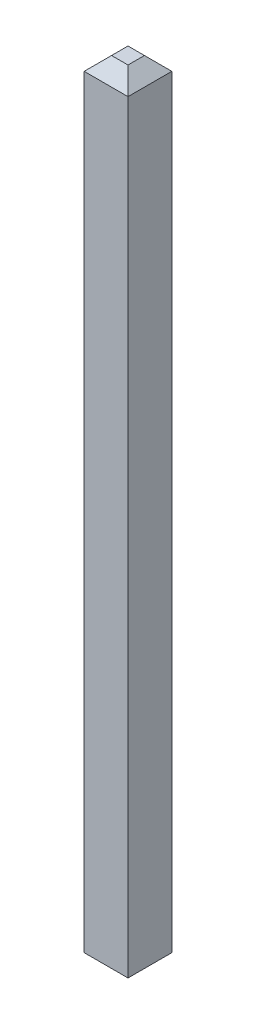
ISO-10303-21;
HEADER;
FILE_DESCRIPTION(('STEP AP214'),'2;1');
FILE_NAME('part.step','',(''),(''),'','','');
FILE_SCHEMA(('AUTOMOTIVE_DESIGN { 1 0 10303 214 1 1 1 1 }'));
ENDSEC;
DATA;
#1=APPLICATION_CONTEXT('core data for automotive mechanical design processes');
#2=APPLICATION_PROTOCOL_DEFINITION('international standard','automotive_design',2000,#1);
#3=PRODUCT_CONTEXT('',#1,'mechanical');
#4=PRODUCT('Part','Part','',(#3));
#5=PRODUCT_RELATED_PRODUCT_CATEGORY('part','',(#4));
#6=PRODUCT_DEFINITION_FORMATION('','',#4);
#7=PRODUCT_DEFINITION_CONTEXT('part definition',#1,'design');
#8=PRODUCT_DEFINITION('design','',#6,#7);
#9=PRODUCT_DEFINITION_SHAPE('','',#8);
#10=(LENGTH_UNIT() NAMED_UNIT(*) SI_UNIT(.MILLI.,.METRE.));
#11=(NAMED_UNIT(*) PLANE_ANGLE_UNIT() SI_UNIT($,.RADIAN.));
#12=(NAMED_UNIT(*) SI_UNIT($,.STERADIAN.) SOLID_ANGLE_UNIT());
#13=UNCERTAINTY_MEASURE_WITH_UNIT(LENGTH_MEASURE(1.E-05),#10,'distance_accuracy_value','');
#14=(GEOMETRIC_REPRESENTATION_CONTEXT(3) GLOBAL_UNCERTAINTY_ASSIGNED_CONTEXT((#13)) GLOBAL_UNIT_ASSIGNED_CONTEXT((#10,
#11,#12)) REPRESENTATION_CONTEXT('',''));
#15=CARTESIAN_POINT('',(0.,0.,0.));
#16=DIRECTION('',(0.,0.,1.));
#17=DIRECTION('',(1.,0.,0.));
#18=AXIS2_PLACEMENT_3D('',#15,#16,#17);
#19=CARTESIAN_POINT('',(-0.95,7.07,-0.32));
#20=DIRECTION('',(-0.707106781186548,-0.707106781186548,0.));
#21=DIRECTION('',(-0.707106781186548,0.707106781186548,0.));
#22=AXIS2_PLACEMENT_3D('',#19,#20,#21);
#23=PLANE('',#22);
#24=DIRECTION('',(0.577350269189626,-0.577350269189626,0.577350269189626));
#25=VECTOR('',#24,1.);
#26=CARTESIAN_POINT('',(-1.163333333333,7.283333333333,0.106666666667));
#27=LINE('',#26,#25);
#28=CARTESIAN_POINT('',(-1.15,7.27,0.12));
#29=VERTEX_POINT('',#28);
#30=CARTESIAN_POINT('',(-0.95,7.07,0.32));
#31=VERTEX_POINT('',#30);
#32=EDGE_CURVE('E70',#29,#31,#27,.T.);
#33=ORIENTED_EDGE('',*,*,#32,.T.);
#34=DIRECTION('',(0.,0.,1.));
#35=VECTOR('',#34,1.);
#36=CARTESIAN_POINT('',(-0.95,7.07,-0.32));
#37=LINE('',#36,#35);
#38=CARTESIAN_POINT('',(-0.95,7.07,-0.32));
#39=VERTEX_POINT('',#38);
#40=EDGE_CURVE('E171',#39,#31,#37,.T.);
#41=ORIENTED_EDGE('',*,*,#40,.F.);
#42=DIRECTION('',(0.577350269189626,-0.577350269189626,-0.577350269189626));
#43=VECTOR('',#42,1.);
#44=CARTESIAN_POINT('',(-0.95,7.07,-0.32));
#45=LINE('',#44,#43);
#46=CARTESIAN_POINT('',(-1.15,7.27,-0.12));
#47=VERTEX_POINT('',#46);
#48=EDGE_CURVE('E11',#47,#39,#45,.T.);
#49=ORIENTED_EDGE('',*,*,#48,.F.);
#50=DIRECTION('',(0.,0.,-1.));
#51=VECTOR('',#50,1.);
#52=CARTESIAN_POINT('',(-1.15,7.27,-0.32));
#53=LINE('',#52,#51);
#54=EDGE_CURVE('E174',#29,#47,#53,.T.);
#55=ORIENTED_EDGE('',*,*,#54,.F.);
#56=EDGE_LOOP('',(#33,#41,#49,#55));
#57=FACE_BOUND('',#56,.T.);
#58=ADVANCED_FACE('F17',(#57),#23,.F.);
#59=CARTESIAN_POINT('',(-1.27,7.07,-0.32));
#60=DIRECTION('',(0.,0.707106781186548,-0.707106781186548));
#61=DIRECTION('',(-1.,0.,0.));
#62=AXIS2_PLACEMENT_3D('',#59,#60,#61);
#63=PLANE('',#62);
#64=DIRECTION('',(0.577350269189626,0.577350269189626,0.577350269189626));
#65=VECTOR('',#64,1.);
#66=CARTESIAN_POINT('',(-1.456666666667,7.203333333333,-0.186666666667));
#67=LINE('',#66,#65);
#68=CARTESIAN_POINT('',(-1.59,7.07,-0.32));
#69=VERTEX_POINT('',#68);
#70=CARTESIAN_POINT('',(-1.39,7.27,-0.12));
#71=VERTEX_POINT('',#70);
#72=EDGE_CURVE('E21',#69,#71,#67,.T.);
#73=ORIENTED_EDGE('',*,*,#72,.T.);
#74=DIRECTION('',(-1.,0.,0.));
#75=VECTOR('',#74,1.);
#76=CARTESIAN_POINT('',(-1.59,7.27,-0.12));
#77=LINE('',#76,#75);
#78=EDGE_CURVE('E178',#47,#71,#77,.T.);
#79=ORIENTED_EDGE('',*,*,#78,.F.);
#80=ORIENTED_EDGE('',*,*,#48,.T.);
#81=DIRECTION('',(1.,0.,0.));
#82=VECTOR('',#81,1.);
#83=CARTESIAN_POINT('',(-0.95,7.07,-0.32));
#84=LINE('',#83,#82);
#85=EDGE_CURVE('E161',#69,#39,#84,.T.);
#86=ORIENTED_EDGE('',*,*,#85,.F.);
#87=EDGE_LOOP('',(#73,#79,#80,#86));
#88=FACE_BOUND('',#87,.T.);
#89=ADVANCED_FACE('F19',(#88),#63,.T.);
#90=CARTESIAN_POINT('',(-1.39,7.27,-0.32));
#91=DIRECTION('',(0.707106781186548,-0.707106781186548,0.));
#92=DIRECTION('',(0.,0.,-1.));
#93=AXIS2_PLACEMENT_3D('',#90,#91,#92);
#94=PLANE('',#93);
#95=DIRECTION('',(-0.577350269189626,-0.577350269189626,0.577350269189626));
#96=VECTOR('',#95,1.);
#97=CARTESIAN_POINT('',(-1.456666666667,7.203333333333,0.186666666667));
#98=LINE('',#97,#96);
#99=CARTESIAN_POINT('',(-1.39,7.27,0.12));
#100=VERTEX_POINT('',#99);
#101=CARTESIAN_POINT('',(-1.59,7.07,0.32));
#102=VERTEX_POINT('',#101);
#103=EDGE_CURVE('E41',#100,#102,#98,.T.);
#104=ORIENTED_EDGE('',*,*,#103,.F.);
#105=DIRECTION('',(0.,0.,1.));
#106=VECTOR('',#105,1.);
#107=CARTESIAN_POINT('',(-1.39,7.27,-0.32));
#108=LINE('',#107,#106);
#109=EDGE_CURVE('E182',#71,#100,#108,.T.);
#110=ORIENTED_EDGE('',*,*,#109,.F.);
#111=ORIENTED_EDGE('',*,*,#72,.F.);
#112=DIRECTION('',(0.,0.,-1.));
#113=VECTOR('',#112,1.);
#114=CARTESIAN_POINT('',(-1.59,7.07,-0.32));
#115=LINE('',#114,#113);
#116=EDGE_CURVE('E148',#102,#69,#115,.T.);
#117=ORIENTED_EDGE('',*,*,#116,.F.);
#118=EDGE_LOOP('',(#104,#110,#111,#117));
#119=FACE_BOUND('',#118,.T.);
#120=ADVANCED_FACE('F249',(#119),#94,.F.);
#121=CARTESIAN_POINT('',(-1.59,7.27,0.12));
#122=DIRECTION('',(0.,-0.707106781186548,-0.707106781186548));
#123=DIRECTION('',(0.,-0.707106781186548,0.707106781186548));
#124=AXIS2_PLACEMENT_3D('',#121,#122,#123);
#125=PLANE('',#124);
#126=ORIENTED_EDGE('',*,*,#32,.F.);
#127=DIRECTION('',(1.,0.,0.));
#128=VECTOR('',#127,1.);
#129=CARTESIAN_POINT('',(-1.59,7.27,0.12));
#130=LINE('',#129,#128);
#131=EDGE_CURVE('E185',#100,#29,#130,.T.);
#132=ORIENTED_EDGE('',*,*,#131,.F.);
#133=ORIENTED_EDGE('',*,*,#103,.T.);
#134=DIRECTION('',(-1.,0.,0.));
#135=VECTOR('',#134,1.);
#136=CARTESIAN_POINT('',(-1.27,7.07,0.32));
#137=LINE('',#136,#135);
#138=EDGE_CURVE('E153',#31,#102,#137,.T.);
#139=ORIENTED_EDGE('',*,*,#138,.F.);
#140=EDGE_LOOP('',(#126,#132,#133,#139));
#141=FACE_BOUND('',#140,.T.);
#142=ADVANCED_FACE('F240',(#141),#125,.F.);
#143=CARTESIAN_POINT('',(-1.59,7.27,-0.32));
#144=DIRECTION('',(0.,-1.,0.));
#145=DIRECTION('',(0.,0.,-1.));
#146=AXIS2_PLACEMENT_3D('',#143,#144,#145);
#147=PLANE('',#146);
#148=ORIENTED_EDGE('',*,*,#54,.T.);
#149=ORIENTED_EDGE('',*,*,#78,.T.);
#150=ORIENTED_EDGE('',*,*,#109,.T.);
#151=ORIENTED_EDGE('',*,*,#131,.T.);
#152=EDGE_LOOP('',(#148,#149,#150,#151));
#153=FACE_BOUND('',#152,.T.);
#154=ADVANCED_FACE('F231',(#153),#147,.F.);
#155=CARTESIAN_POINT('',(-0.95,7.27,-0.32));
#156=DIRECTION('',(-1.,0.,0.));
#157=DIRECTION('',(0.,1.,0.));
#158=AXIS2_PLACEMENT_3D('',#155,#156,#157);
#159=PLANE('',#158);
#160=DIRECTION('',(0.,-1.,0.));
#161=VECTOR('',#160,1.);
#162=CARTESIAN_POINT('',(-0.95,7.27,-0.32));
#163=LINE('',#162,#161);
#164=CARTESIAN_POINT('',(-0.95,-4.07,-0.32));
#165=VERTEX_POINT('',#164);
#166=EDGE_CURVE('E155',#39,#165,#163,.T.);
#167=ORIENTED_EDGE('',*,*,#166,.F.);
#168=ORIENTED_EDGE('',*,*,#40,.T.);
#169=DIRECTION('',(0.,-1.,0.));
#170=VECTOR('',#169,1.);
#171=CARTESIAN_POINT('',(-0.95,7.27,0.32));
#172=LINE('',#171,#170);
#173=CARTESIAN_POINT('',(-0.95,-4.07,0.32));
#174=VERTEX_POINT('',#173);
#175=EDGE_CURVE('E82',#31,#174,#172,.T.);
#176=ORIENTED_EDGE('',*,*,#175,.T.);
#177=DIRECTION('',(0.,0.,-1.));
#178=VECTOR('',#177,1.);
#179=CARTESIAN_POINT('',(-0.95,-4.07,-0.32));
#180=LINE('',#179,#178);
#181=EDGE_CURVE('E115',#174,#165,#180,.T.);
#182=ORIENTED_EDGE('',*,*,#181,.T.);
#183=EDGE_LOOP('',(#167,#168,#176,#182));
#184=FACE_BOUND('',#183,.T.);
#185=ADVANCED_FACE('F229',(#184),#159,.F.);
#186=CARTESIAN_POINT('',(-1.27,1.5,0.32));
#187=DIRECTION('',(0.,0.,-1.));
#188=DIRECTION('',(0.,-1.,0.));
#189=AXIS2_PLACEMENT_3D('',#186,#187,#188);
#190=PLANE('',#189);
#191=ORIENTED_EDGE('',*,*,#175,.F.);
#192=ORIENTED_EDGE('',*,*,#138,.T.);
#193=DIRECTION('',(0.,1.,0.));
#194=VECTOR('',#193,1.);
#195=CARTESIAN_POINT('',(-1.59,-4.27,0.32));
#196=LINE('',#195,#194);
#197=CARTESIAN_POINT('',(-1.59,-4.07,0.32));
#198=VERTEX_POINT('',#197);
#199=EDGE_CURVE('E143',#198,#102,#196,.T.);
#200=ORIENTED_EDGE('',*,*,#199,.F.);
#201=DIRECTION('',(1.,0.,0.));
#202=VECTOR('',#201,1.);
#203=CARTESIAN_POINT('',(-1.27,-4.07,0.32));
#204=LINE('',#203,#202);
#205=EDGE_CURVE('E124',#198,#174,#204,.T.);
#206=ORIENTED_EDGE('',*,*,#205,.T.);
#207=EDGE_LOOP('',(#191,#192,#200,#206));
#208=FACE_BOUND('',#207,.T.);
#209=ADVANCED_FACE('F151',(#208),#190,.F.);
#210=CARTESIAN_POINT('',(-1.15,-4.27,-0.32));
#211=DIRECTION('',(-0.707106781186548,0.707106781186548,0.));
#212=DIRECTION('',(0.,0.,1.));
#213=AXIS2_PLACEMENT_3D('',#210,#211,#212);
#214=PLANE('',#213);
#215=DIRECTION('',(-0.577350269189626,-0.577350269189626,0.577350269189626));
#216=VECTOR('',#215,1.);
#217=CARTESIAN_POINT('',(-1.083333333333,-4.203333333333,-0.186666666667));
#218=LINE('',#217,#216);
#219=CARTESIAN_POINT('',(-1.15,-4.27,-0.12));
#220=VERTEX_POINT('',#219);
#221=EDGE_CURVE('E210',#165,#220,#218,.T.);
#222=ORIENTED_EDGE('',*,*,#221,.F.);
#223=ORIENTED_EDGE('',*,*,#181,.F.);
#224=DIRECTION('',(-0.577350269189626,-0.577350269189626,-0.577350269189626));
#225=VECTOR('',#224,1.);
#226=CARTESIAN_POINT('',(-1.296666666667,-4.416666666667,-0.02666666666667));
#227=LINE('',#226,#225);
#228=CARTESIAN_POINT('',(-1.15,-4.27,0.12));
#229=VERTEX_POINT('',#228);
#230=EDGE_CURVE('E128',#174,#229,#227,.T.);
#231=ORIENTED_EDGE('',*,*,#230,.T.);
#232=DIRECTION('',(0.,0.,1.));
#233=VECTOR('',#232,1.);
#234=CARTESIAN_POINT('',(-1.15,-4.27,-0.32));
#235=LINE('',#234,#233);
#236=EDGE_CURVE('E263',#220,#229,#235,.T.);
#237=ORIENTED_EDGE('',*,*,#236,.F.);
#238=EDGE_LOOP('',(#222,#223,#231,#237));
#239=FACE_BOUND('',#238,.T.);
#240=ADVANCED_FACE('F238',(#239),#214,.F.);
#241=CARTESIAN_POINT('',(-0.95,-4.27,0.12));
#242=DIRECTION('',(0.,0.707106781186548,-0.707106781186548));
#243=DIRECTION('',(-1.,0.,0.));
#244=AXIS2_PLACEMENT_3D('',#241,#242,#243);
#245=PLANE('',#244);
#246=ORIENTED_EDGE('',*,*,#230,.F.);
#247=ORIENTED_EDGE('',*,*,#205,.F.);
#248=DIRECTION('',(-0.577350269189626,0.577350269189626,0.577350269189626));
#249=VECTOR('',#248,1.);
#250=CARTESIAN_POINT('',(-1.376666666667,-4.283333333333,0.106666666667));
#251=LINE('',#250,#249);
#252=CARTESIAN_POINT('',(-1.39,-4.27,0.12));
#253=VERTEX_POINT('',#252);
#254=EDGE_CURVE('E127',#253,#198,#251,.T.);
#255=ORIENTED_EDGE('',*,*,#254,.F.);
#256=DIRECTION('',(-1.,0.,0.));
#257=VECTOR('',#256,1.);
#258=CARTESIAN_POINT('',(-0.95,-4.27,0.12));
#259=LINE('',#258,#257);
#260=EDGE_CURVE('E200',#229,#253,#259,.T.);
#261=ORIENTED_EDGE('',*,*,#260,.F.);
#262=EDGE_LOOP('',(#246,#247,#255,#261));
#263=FACE_BOUND('',#262,.T.);
#264=ADVANCED_FACE('F125',(#263),#245,.F.);
#265=CARTESIAN_POINT('',(-1.59,-4.07,-0.32));
#266=DIRECTION('',(0.707106781186548,0.707106781186548,0.));
#267=DIRECTION('',(0.,0.,-1.));
#268=AXIS2_PLACEMENT_3D('',#265,#266,#267);
#269=PLANE('',#268);
#270=DIRECTION('',(0.577350269189626,-0.577350269189626,0.577350269189626));
#271=VECTOR('',#270,1.);
#272=CARTESIAN_POINT('',(-1.483333333333,-4.176666666667,-0.213333333333));
#273=LINE('',#272,#271);
#274=CARTESIAN_POINT('',(-1.59,-4.07,-0.32));
#275=VERTEX_POINT('',#274);
#276=CARTESIAN_POINT('',(-1.39,-4.27,-0.12));
#277=VERTEX_POINT('',#276);
#278=EDGE_CURVE('E104',#275,#277,#273,.T.);
#279=ORIENTED_EDGE('',*,*,#278,.T.);
#280=DIRECTION('',(0.,0.,-1.));
#281=VECTOR('',#280,1.);
#282=CARTESIAN_POINT('',(-1.39,-4.27,-0.32));
#283=LINE('',#282,#281);
#284=EDGE_CURVE('E135',#253,#277,#283,.T.);
#285=ORIENTED_EDGE('',*,*,#284,.F.);
#286=ORIENTED_EDGE('',*,*,#254,.T.);
#287=DIRECTION('',(0.,0.,1.));
#288=VECTOR('',#287,1.);
#289=CARTESIAN_POINT('',(-1.59,-4.07,-0.32));
#290=LINE('',#289,#288);
#291=EDGE_CURVE('E109',#275,#198,#290,.T.);
#292=ORIENTED_EDGE('',*,*,#291,.F.);
#293=EDGE_LOOP('',(#279,#285,#286,#292));
#294=FACE_BOUND('',#293,.T.);
#295=ADVANCED_FACE('F133',(#294),#269,.F.);
#296=CARTESIAN_POINT('',(-1.59,-4.27,-0.32));
#297=DIRECTION('',(1.,0.,0.));
#298=DIRECTION('',(0.,0.,1.));
#299=AXIS2_PLACEMENT_3D('',#296,#297,#298);
#300=PLANE('',#299);
#301=ORIENTED_EDGE('',*,*,#199,.T.);
#302=ORIENTED_EDGE('',*,*,#116,.T.);
#303=DIRECTION('',(0.,1.,0.));
#304=VECTOR('',#303,1.);
#305=CARTESIAN_POINT('',(-1.59,-4.27,-0.32));
#306=LINE('',#305,#304);
#307=EDGE_CURVE('E145',#275,#69,#306,.T.);
#308=ORIENTED_EDGE('',*,*,#307,.F.);
#309=ORIENTED_EDGE('',*,*,#291,.T.);
#310=EDGE_LOOP('',(#301,#302,#308,#309));
#311=FACE_BOUND('',#310,.T.);
#312=ADVANCED_FACE('F141',(#311),#300,.F.);
#313=CARTESIAN_POINT('',(-1.27,1.5,-0.32));
#314=DIRECTION('',(0.,0.,-1.));
#315=DIRECTION('',(0.,-1.,0.));
#316=AXIS2_PLACEMENT_3D('',#313,#314,#315);
#317=PLANE('',#316);
#318=ORIENTED_EDGE('',*,*,#307,.T.);
#319=ORIENTED_EDGE('',*,*,#85,.T.);
#320=ORIENTED_EDGE('',*,*,#166,.T.);
#321=DIRECTION('',(-1.,0.,0.));
#322=VECTOR('',#321,1.);
#323=CARTESIAN_POINT('',(-1.59,-4.07,-0.32));
#324=LINE('',#323,#322);
#325=EDGE_CURVE('E207',#165,#275,#324,.T.);
#326=ORIENTED_EDGE('',*,*,#325,.T.);
#327=EDGE_LOOP('',(#318,#319,#320,#326));
#328=FACE_BOUND('',#327,.T.);
#329=ADVANCED_FACE('F224',(#328),#317,.T.);
#330=CARTESIAN_POINT('',(-1.27,-4.07,-0.32));
#331=DIRECTION('',(0.,-0.707106781186548,-0.707106781186548));
#332=DIRECTION('',(0.,-0.707106781186548,0.707106781186548));
#333=AXIS2_PLACEMENT_3D('',#330,#331,#332);
#334=PLANE('',#333);
#335=ORIENTED_EDGE('',*,*,#278,.F.);
#336=ORIENTED_EDGE('',*,*,#325,.F.);
#337=ORIENTED_EDGE('',*,*,#221,.T.);
#338=DIRECTION('',(1.,0.,0.));
#339=VECTOR('',#338,1.);
#340=CARTESIAN_POINT('',(-0.95,-4.27,-0.12));
#341=LINE('',#340,#339);
#342=EDGE_CURVE('E203',#277,#220,#341,.T.);
#343=ORIENTED_EDGE('',*,*,#342,.F.);
#344=EDGE_LOOP('',(#335,#336,#337,#343));
#345=FACE_BOUND('',#344,.T.);
#346=ADVANCED_FACE('F252',(#345),#334,.T.);
#347=CARTESIAN_POINT('',(-0.95,-4.27,-0.32));
#348=DIRECTION('',(0.,1.,0.));
#349=DIRECTION('',(0.,0.,-1.));
#350=AXIS2_PLACEMENT_3D('',#347,#348,#349);
#351=PLANE('',#350);
#352=ORIENTED_EDGE('',*,*,#236,.T.);
#353=ORIENTED_EDGE('',*,*,#260,.T.);
#354=ORIENTED_EDGE('',*,*,#284,.T.);
#355=ORIENTED_EDGE('',*,*,#342,.T.);
#356=EDGE_LOOP('',(#352,#353,#354,#355));
#357=FACE_BOUND('',#356,.T.);
#358=ADVANCED_FACE('F251',(#357),#351,.F.);
#359=CLOSED_SHELL('',(#58,#89,#120,#142,#154,#185,#209,#240,#264,#295,#312,#329,#346,#358));
#360=MANIFOLD_SOLID_BREP('B1',#359);
#361=ADVANCED_BREP_SHAPE_REPRESENTATION('',(#18,#360),#14);
#362=SHAPE_DEFINITION_REPRESENTATION(#9,#361);
ENDSEC;
END-ISO-10303-21;
